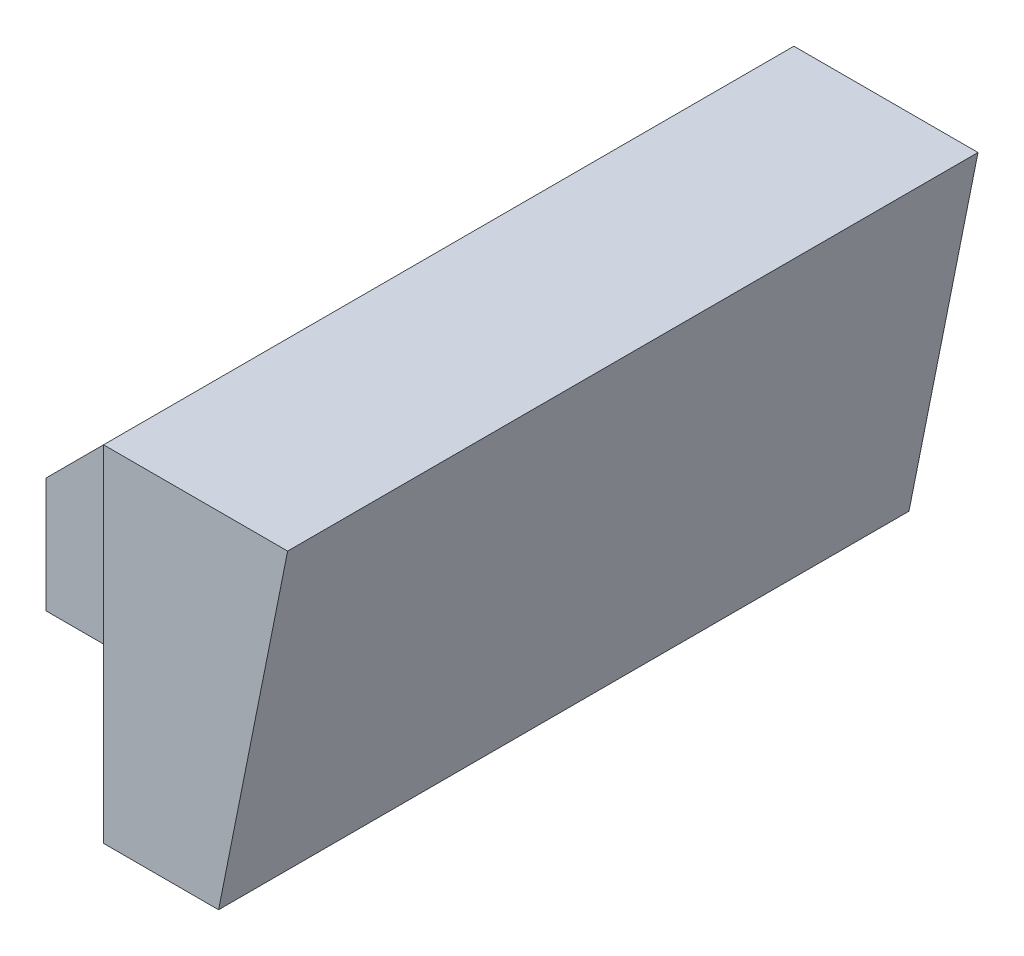
ISO-10303-21;
HEADER;
FILE_DESCRIPTION(('STEP AP214'),'2;1');
FILE_NAME('part.step','',(''),(''),'','','');
FILE_SCHEMA(('AUTOMOTIVE_DESIGN { 1 0 10303 214 1 1 1 1 }'));
ENDSEC;
DATA;
#1=APPLICATION_CONTEXT('core data for automotive mechanical design processes');
#2=APPLICATION_PROTOCOL_DEFINITION('international standard','automotive_design',2000,#1);
#3=PRODUCT_CONTEXT('',#1,'mechanical');
#4=PRODUCT('Part','Part','',(#3));
#5=PRODUCT_RELATED_PRODUCT_CATEGORY('part','',(#4));
#6=PRODUCT_DEFINITION_FORMATION('','',#4);
#7=PRODUCT_DEFINITION_CONTEXT('part definition',#1,'design');
#8=PRODUCT_DEFINITION('design','',#6,#7);
#9=PRODUCT_DEFINITION_SHAPE('','',#8);
#10=(LENGTH_UNIT() NAMED_UNIT(*) SI_UNIT(.MILLI.,.METRE.));
#11=(NAMED_UNIT(*) PLANE_ANGLE_UNIT() SI_UNIT($,.RADIAN.));
#12=(NAMED_UNIT(*) SI_UNIT($,.STERADIAN.) SOLID_ANGLE_UNIT());
#13=UNCERTAINTY_MEASURE_WITH_UNIT(LENGTH_MEASURE(1.E-05),#10,'distance_accuracy_value','');
#14=(GEOMETRIC_REPRESENTATION_CONTEXT(3) GLOBAL_UNCERTAINTY_ASSIGNED_CONTEXT((#13)) GLOBAL_UNIT_ASSIGNED_CONTEXT((#10,
#11,#12)) REPRESENTATION_CONTEXT('',''));
#15=CARTESIAN_POINT('',(0.,0.,0.));
#16=DIRECTION('',(0.,0.,1.));
#17=DIRECTION('',(1.,0.,0.));
#18=AXIS2_PLACEMENT_3D('',#15,#16,#17);
#19=CARTESIAN_POINT('',(0.,0.,0.));
#20=DIRECTION('',(0.,-1.,0.));
#21=DIRECTION('',(0.,0.,-1.));
#22=AXIS2_PLACEMENT_3D('',#19,#20,#21);
#23=PLANE('',#22);
#24=CARTESIAN_POINT('',(-9.,0.,0.));
#25=DIRECTION('',(0.,1.,0.));
#26=DIRECTION('',(0.,0.,1.));
#27=AXIS2_PLACEMENT_3D('',#24,#25,#26);
#28=CIRCLE('',#27,1.6);
#29=CARTESIAN_POINT('',(-7.42986451419408,0.,-0.307692307692306));
#30=VERTEX_POINT('',#29);
#31=CARTESIAN_POINT('',(-10.5701354858059,0.,-0.307692307692306));
#32=VERTEX_POINT('',#31);
#33=EDGE_CURVE('E243',#30,#32,#28,.T.);
#34=ORIENTED_EDGE('',*,*,#33,.T.);
#35=CARTESIAN_POINT('',(-11.5514701644346,0.,-0.499999999999999));
#36=DIRECTION('',(0.,-1.,0.));
#37=DIRECTION('',(0.,0.,-1.));
#38=AXIS2_PLACEMENT_3D('',#35,#36,#37);
#39=CIRCLE('',#38,1.);
#40=CARTESIAN_POINT('',(-11.5514701644346,0.,-1.5));
#41=VERTEX_POINT('',#40);
#42=EDGE_CURVE('E366',#32,#41,#39,.F.);
#43=ORIENTED_EDGE('',*,*,#42,.T.);
#44=DIRECTION('',(1.,0.,0.));
#45=VECTOR('',#44,1.);
#46=CARTESIAN_POINT('',(-14.,0.,-1.5));
#47=LINE('',#46,#45);
#48=CARTESIAN_POINT('',(-14.,0.,-1.5));
#49=VERTEX_POINT('',#48);
#50=EDGE_CURVE('E399',#49,#41,#47,.T.);
#51=ORIENTED_EDGE('',*,*,#50,.F.);
#52=DIRECTION('',(0.,0.,-1.));
#53=VECTOR('',#52,1.);
#54=CARTESIAN_POINT('',(-14.,0.,7.5));
#55=LINE('',#54,#53);
#56=CARTESIAN_POINT('',(-14.,0.,-7.5));
#57=VERTEX_POINT('',#56);
#58=EDGE_CURVE('E212',#49,#57,#55,.T.);
#59=ORIENTED_EDGE('',*,*,#58,.T.);
#60=DIRECTION('',(1.,0.,0.));
#61=VECTOR('',#60,1.);
#62=CARTESIAN_POINT('',(-14.,0.,-7.5));
#63=LINE('',#62,#61);
#64=CARTESIAN_POINT('',(-4.,0.,-7.5));
#65=VERTEX_POINT('',#64);
#66=EDGE_CURVE('E285',#57,#65,#63,.T.);
#67=ORIENTED_EDGE('',*,*,#66,.T.);
#68=DIRECTION('',(0.,0.,1.));
#69=VECTOR('',#68,1.);
#70=CARTESIAN_POINT('',(-4.,0.,15.));
#71=LINE('',#70,#69);
#72=CARTESIAN_POINT('',(-4.,0.,-15.));
#73=VERTEX_POINT('',#72);
#74=EDGE_CURVE('E325',#73,#65,#71,.T.);
#75=ORIENTED_EDGE('',*,*,#74,.F.);
#76=DIRECTION('',(-1.,0.,0.));
#77=VECTOR('',#76,1.);
#78=CARTESIAN_POINT('',(-4.,0.,-15.));
#79=LINE('',#78,#77);
#80=CARTESIAN_POINT('',(0.999999999999999,0.,-15.));
#81=VERTEX_POINT('',#80);
#82=EDGE_CURVE('E308',#81,#73,#79,.T.);
#83=ORIENTED_EDGE('',*,*,#82,.F.);
#84=DIRECTION('',(0.,0.,1.));
#85=VECTOR('',#84,1.);
#86=CARTESIAN_POINT('',(0.999999999999999,0.,-15.));
#87=LINE('',#86,#85);
#88=CARTESIAN_POINT('',(0.999999999999999,0.,15.));
#89=VERTEX_POINT('',#88);
#90=EDGE_CURVE('E304',#81,#89,#87,.T.);
#91=ORIENTED_EDGE('',*,*,#90,.T.);
#92=DIRECTION('',(1.,0.,0.));
#93=VECTOR('',#92,1.);
#94=CARTESIAN_POINT('',(-4.,0.,15.));
#95=LINE('',#94,#93);
#96=CARTESIAN_POINT('',(-4.,0.,15.));
#97=VERTEX_POINT('',#96);
#98=EDGE_CURVE('E313',#97,#89,#95,.T.);
#99=ORIENTED_EDGE('',*,*,#98,.F.);
#100=CARTESIAN_POINT('',(-4.,0.,7.5));
#101=VERTEX_POINT('',#100);
#102=EDGE_CURVE('E324',#101,#97,#71,.T.);
#103=ORIENTED_EDGE('',*,*,#102,.F.);
#104=DIRECTION('',(1.,0.,0.));
#105=VECTOR('',#104,1.);
#106=CARTESIAN_POINT('',(-14.,0.,7.5));
#107=LINE('',#106,#105);
#108=CARTESIAN_POINT('',(-14.,0.,7.5));
#109=VERTEX_POINT('',#108);
#110=EDGE_CURVE('E274',#109,#101,#107,.T.);
#111=ORIENTED_EDGE('',*,*,#110,.F.);
#112=CARTESIAN_POINT('',(-14.,0.,1.5));
#113=VERTEX_POINT('',#112);
#114=EDGE_CURVE('E293',#109,#113,#55,.T.);
#115=ORIENTED_EDGE('',*,*,#114,.T.);
#116=DIRECTION('',(-1.,0.,0.));
#117=VECTOR('',#116,1.);
#118=CARTESIAN_POINT('',(-14.,0.,1.5));
#119=LINE('',#118,#117);
#120=CARTESIAN_POINT('',(-11.5514701644346,0.,1.5));
#121=VERTEX_POINT('',#120);
#122=EDGE_CURVE('E207',#121,#113,#119,.T.);
#123=ORIENTED_EDGE('',*,*,#122,.F.);
#124=CARTESIAN_POINT('',(-11.5514701644346,0.,0.500000000000002));
#125=DIRECTION('',(0.,-1.,0.));
#126=DIRECTION('',(0.,0.,-1.));
#127=AXIS2_PLACEMENT_3D('',#124,#125,#126);
#128=CIRCLE('',#127,1.);
#129=CARTESIAN_POINT('',(-10.5701354858059,0.,0.307692307692309));
#130=VERTEX_POINT('',#129);
#131=EDGE_CURVE('E11',#121,#130,#128,.F.);
#132=ORIENTED_EDGE('',*,*,#131,.T.);
#133=CARTESIAN_POINT('',(-7.42986451419408,0.,0.307692307692309));
#134=VERTEX_POINT('',#133);
#135=EDGE_CURVE('E246',#130,#134,#28,.T.);
#136=ORIENTED_EDGE('',*,*,#135,.T.);
#137=CARTESIAN_POINT('',(-6.44852983556539,0.,0.500000000000002));
#138=DIRECTION('',(0.,-1.,0.));
#139=DIRECTION('',(0.,0.,-1.));
#140=AXIS2_PLACEMENT_3D('',#137,#138,#139);
#141=CIRCLE('',#140,1.);
#142=CARTESIAN_POINT('',(-6.44852983556539,0.,1.5));
#143=VERTEX_POINT('',#142);
#144=EDGE_CURVE('E41',#134,#143,#141,.F.);
#145=ORIENTED_EDGE('',*,*,#144,.T.);
#146=DIRECTION('',(-1.,0.,0.));
#147=VECTOR('',#146,1.);
#148=CARTESIAN_POINT('',(-8.443223563717,0.,1.5));
#149=LINE('',#148,#147);
#150=CARTESIAN_POINT('',(-4.,0.,1.5));
#151=VERTEX_POINT('',#150);
#152=EDGE_CURVE('E217',#151,#143,#149,.T.);
#153=ORIENTED_EDGE('',*,*,#152,.F.);
#154=DIRECTION('',(0.,0.,1.));
#155=VECTOR('',#154,1.);
#156=CARTESIAN_POINT('',(-4.,0.,-1.5));
#157=LINE('',#156,#155);
#158=CARTESIAN_POINT('',(-4.,0.,-1.5));
#159=VERTEX_POINT('',#158);
#160=EDGE_CURVE('E213',#159,#151,#157,.T.);
#161=ORIENTED_EDGE('',*,*,#160,.F.);
#162=DIRECTION('',(1.,0.,0.));
#163=VECTOR('',#162,1.);
#164=CARTESIAN_POINT('',(-8.443223563717,0.,-1.5));
#165=LINE('',#164,#163);
#166=CARTESIAN_POINT('',(-6.44852983556539,0.,-1.5));
#167=VERTEX_POINT('',#166);
#168=EDGE_CURVE('E226',#167,#159,#165,.T.);
#169=ORIENTED_EDGE('',*,*,#168,.F.);
#170=CARTESIAN_POINT('',(-6.44852983556539,0.,-0.499999999999999));
#171=DIRECTION('',(0.,-1.,0.));
#172=DIRECTION('',(0.,0.,-1.));
#173=AXIS2_PLACEMENT_3D('',#170,#171,#172);
#174=CIRCLE('',#173,1.);
#175=EDGE_CURVE('E368',#167,#30,#174,.F.);
#176=ORIENTED_EDGE('',*,*,#175,.T.);
#177=EDGE_LOOP('',(#34,#43,#51,#59,#67,#75,#83,#91,#99,#103,#111,#115,#123,#132,#136,#145,#153,
#161,#169,#176));
#178=FACE_BOUND('',#177,.T.);
#179=ADVANCED_FACE('F33',(#178),#23,.T.);
#180=CARTESIAN_POINT('',(-14.,5.,7.5));
#181=DIRECTION('',(0.707106781186547,-0.707106781186548,0.));
#182=DIRECTION('',(0.707106781186548,0.707106781186547,0.));
#183=AXIS2_PLACEMENT_3D('',#180,#181,#182);
#184=PLANE('',#183);
#185=DIRECTION('',(0.,0.,-1.));
#186=VECTOR('',#185,1.);
#187=CARTESIAN_POINT('',(-14.,5.,7.5));
#188=LINE('',#187,#186);
#189=CARTESIAN_POINT('',(-14.,5.,-4.5));
#190=VERTEX_POINT('',#189);
#191=CARTESIAN_POINT('',(-14.,5.,-7.5));
#192=VERTEX_POINT('',#191);
#193=EDGE_CURVE('E296',#190,#192,#188,.T.);
#194=ORIENTED_EDGE('',*,*,#193,.F.);
#195=DIRECTION('',(0.707106781186548,0.707106781186547,0.));
#196=VECTOR('',#195,1.);
#197=CARTESIAN_POINT('',(-14.,5.,-4.5));
#198=LINE('',#197,#196);
#199=CARTESIAN_POINT('',(-4.,15.,-4.5));
#200=VERTEX_POINT('',#199);
#201=EDGE_CURVE('E337',#190,#200,#198,.T.);
#202=ORIENTED_EDGE('',*,*,#201,.T.);
#203=DIRECTION('',(0.,0.,-1.));
#204=VECTOR('',#203,1.);
#205=CARTESIAN_POINT('',(-4.,15.,7.5));
#206=LINE('',#205,#204);
#207=CARTESIAN_POINT('',(-4.,15.,-7.5));
#208=VERTEX_POINT('',#207);
#209=EDGE_CURVE('E280',#200,#208,#206,.T.);
#210=ORIENTED_EDGE('',*,*,#209,.T.);
#211=DIRECTION('',(-0.707106781186548,-0.707106781186547,0.));
#212=VECTOR('',#211,1.);
#213=CARTESIAN_POINT('',(-14.,5.,-7.5));
#214=LINE('',#213,#212);
#215=EDGE_CURVE('E265',#208,#192,#214,.T.);
#216=ORIENTED_EDGE('',*,*,#215,.T.);
#217=EDGE_LOOP('',(#194,#202,#210,#216));
#218=FACE_BOUND('',#217,.T.);
#219=ADVANCED_FACE('F424',(#218),#184,.F.);
#220=CARTESIAN_POINT('',(-4.,15.,15.));
#221=DIRECTION('',(1.,0.,0.));
#222=DIRECTION('',(0.,0.,-1.));
#223=AXIS2_PLACEMENT_3D('',#220,#221,#222);
#224=PLANE('',#223);
#225=DIRECTION('',(0.,1.,0.));
#226=VECTOR('',#225,1.);
#227=CARTESIAN_POINT('',(-4.,0.,7.5));
#228=LINE('',#227,#226);
#229=CARTESIAN_POINT('',(-4.,15.,7.5));
#230=VERTEX_POINT('',#229);
#231=EDGE_CURVE('E277',#101,#230,#228,.T.);
#232=ORIENTED_EDGE('',*,*,#231,.F.);
#233=ORIENTED_EDGE('',*,*,#102,.T.);
#234=DIRECTION('',(0.,-1.,0.));
#235=VECTOR('',#234,1.);
#236=CARTESIAN_POINT('',(-4.,15.,15.));
#237=LINE('',#236,#235);
#238=CARTESIAN_POINT('',(-4.,15.,15.));
#239=VERTEX_POINT('',#238);
#240=EDGE_CURVE('E322',#239,#97,#237,.T.);
#241=ORIENTED_EDGE('',*,*,#240,.F.);
#242=DIRECTION('',(0.,0.,1.));
#243=VECTOR('',#242,1.);
#244=CARTESIAN_POINT('',(-4.,15.,15.));
#245=LINE('',#244,#243);
#246=EDGE_CURVE('E315',#230,#239,#245,.T.);
#247=ORIENTED_EDGE('',*,*,#246,.F.);
#248=EDGE_LOOP('',(#232,#233,#241,#247));
#249=FACE_BOUND('',#248,.T.);
#250=ADVANCED_FACE('F454',(#249),#224,.F.);
#251=CARTESIAN_POINT('',(-4.,15.,-15.));
#252=DIRECTION('',(0.,0.,1.));
#253=DIRECTION('',(1.,0.,0.));
#254=AXIS2_PLACEMENT_3D('',#251,#252,#253);
#255=PLANE('',#254);
#256=DIRECTION('',(-1.,0.,0.));
#257=VECTOR('',#256,1.);
#258=CARTESIAN_POINT('',(-4.,15.,-15.));
#259=LINE('',#258,#257);
#260=CARTESIAN_POINT('',(4.,15.,-15.));
#261=VERTEX_POINT('',#260);
#262=CARTESIAN_POINT('',(-4.,15.,-15.));
#263=VERTEX_POINT('',#262);
#264=EDGE_CURVE('E312',#261,#263,#259,.T.);
#265=ORIENTED_EDGE('',*,*,#264,.F.);
#266=DIRECTION('',(-0.196116135138184,-0.98058067569092,0.));
#267=VECTOR('',#266,1.);
#268=CARTESIAN_POINT('',(4.,15.,-15.));
#269=LINE('',#268,#267);
#270=EDGE_CURVE('E301',#261,#81,#269,.T.);
#271=ORIENTED_EDGE('',*,*,#270,.T.);
#272=ORIENTED_EDGE('',*,*,#82,.T.);
#273=DIRECTION('',(0.,-1.,0.));
#274=VECTOR('',#273,1.);
#275=CARTESIAN_POINT('',(-4.,15.,-15.));
#276=LINE('',#275,#274);
#277=EDGE_CURVE('E331',#263,#73,#276,.T.);
#278=ORIENTED_EDGE('',*,*,#277,.F.);
#279=EDGE_LOOP('',(#265,#271,#272,#278));
#280=FACE_BOUND('',#279,.T.);
#281=ADVANCED_FACE('F465',(#280),#255,.F.);
#282=ORIENTED_EDGE('',*,*,#74,.T.);
#283=DIRECTION('',(0.,1.,0.));
#284=VECTOR('',#283,1.);
#285=CARTESIAN_POINT('',(-4.,0.,-7.5));
#286=LINE('',#285,#284);
#287=EDGE_CURVE('E272',#65,#208,#286,.T.);
#288=ORIENTED_EDGE('',*,*,#287,.T.);
#289=EDGE_CURVE('E316',#263,#208,#245,.T.);
#290=ORIENTED_EDGE('',*,*,#289,.F.);
#291=ORIENTED_EDGE('',*,*,#277,.T.);
#292=EDGE_LOOP('',(#282,#288,#290,#291));
#293=FACE_BOUND('',#292,.T.);
#294=ADVANCED_FACE('F428',(#293),#224,.F.);
#295=CARTESIAN_POINT('',(-4.,15.,15.));
#296=DIRECTION('',(0.,0.,-1.));
#297=DIRECTION('',(-1.,0.,0.));
#298=AXIS2_PLACEMENT_3D('',#295,#296,#297);
#299=PLANE('',#298);
#300=ORIENTED_EDGE('',*,*,#98,.T.);
#301=DIRECTION('',(-0.196116135138184,-0.98058067569092,0.));
#302=VECTOR('',#301,1.);
#303=CARTESIAN_POINT('',(4.,15.,15.));
#304=LINE('',#303,#302);
#305=CARTESIAN_POINT('',(4.,15.,15.));
#306=VERTEX_POINT('',#305);
#307=EDGE_CURVE('E300',#306,#89,#304,.T.);
#308=ORIENTED_EDGE('',*,*,#307,.F.);
#309=DIRECTION('',(1.,0.,0.));
#310=VECTOR('',#309,1.);
#311=CARTESIAN_POINT('',(-4.,15.,15.));
#312=LINE('',#311,#310);
#313=EDGE_CURVE('E319',#239,#306,#312,.T.);
#314=ORIENTED_EDGE('',*,*,#313,.F.);
#315=ORIENTED_EDGE('',*,*,#240,.T.);
#316=EDGE_LOOP('',(#300,#308,#314,#315));
#317=FACE_BOUND('',#316,.T.);
#318=ADVANCED_FACE('F459',(#317),#299,.F.);
#319=CARTESIAN_POINT('',(0.,15.,0.));
#320=DIRECTION('',(0.,-1.,0.));
#321=DIRECTION('',(0.,0.,-1.));
#322=AXIS2_PLACEMENT_3D('',#319,#320,#321);
#323=PLANE('',#322);
#324=DIRECTION('',(0.,0.,-1.));
#325=VECTOR('',#324,1.);
#326=CARTESIAN_POINT('',(4.,15.,15.));
#327=LINE('',#326,#325);
#328=EDGE_CURVE('E309',#306,#261,#327,.T.);
#329=ORIENTED_EDGE('',*,*,#328,.T.);
#330=ORIENTED_EDGE('',*,*,#264,.T.);
#331=ORIENTED_EDGE('',*,*,#289,.T.);
#332=ORIENTED_EDGE('',*,*,#209,.F.);
#333=DIRECTION('',(0.,0.,-1.));
#334=VECTOR('',#333,1.);
#335=CARTESIAN_POINT('',(-4.,15.,-4.5));
#336=LINE('',#335,#334);
#337=CARTESIAN_POINT('',(-4.,15.,4.5));
#338=VERTEX_POINT('',#337);
#339=EDGE_CURVE('E245',#338,#200,#336,.T.);
#340=ORIENTED_EDGE('',*,*,#339,.F.);
#341=EDGE_CURVE('E290',#230,#338,#206,.T.);
#342=ORIENTED_EDGE('',*,*,#341,.F.);
#343=ORIENTED_EDGE('',*,*,#246,.T.);
#344=ORIENTED_EDGE('',*,*,#313,.T.);
#345=EDGE_LOOP('',(#329,#330,#331,#332,#340,#342,#343,#344));
#346=FACE_BOUND('',#345,.T.);
#347=ADVANCED_FACE('F418',(#346),#323,.F.);
#348=CARTESIAN_POINT('',(4.,15.,-15.));
#349=DIRECTION('',(-0.98058067569092,0.196116135138184,0.));
#350=DIRECTION('',(-0.196116135138184,-0.98058067569092,0.));
#351=AXIS2_PLACEMENT_3D('',#348,#349,#350);
#352=PLANE('',#351);
#353=ORIENTED_EDGE('',*,*,#307,.T.);
#354=ORIENTED_EDGE('',*,*,#90,.F.);
#355=ORIENTED_EDGE('',*,*,#270,.F.);
#356=ORIENTED_EDGE('',*,*,#328,.F.);
#357=EDGE_LOOP('',(#353,#354,#355,#356));
#358=FACE_BOUND('',#357,.T.);
#359=ADVANCED_FACE('F618',(#358),#352,.F.);
#360=ORIENTED_EDGE('',*,*,#341,.T.);
#361=DIRECTION('',(-0.707106781186548,-0.707106781186547,0.));
#362=VECTOR('',#361,1.);
#363=CARTESIAN_POINT('',(-14.,5.,4.5));
#364=LINE('',#363,#362);
#365=CARTESIAN_POINT('',(-14.,5.,4.5));
#366=VERTEX_POINT('',#365);
#367=EDGE_CURVE('E334',#338,#366,#364,.T.);
#368=ORIENTED_EDGE('',*,*,#367,.T.);
#369=CARTESIAN_POINT('',(-14.,5.,7.5));
#370=VERTEX_POINT('',#369);
#371=EDGE_CURVE('E297',#370,#366,#188,.T.);
#372=ORIENTED_EDGE('',*,*,#371,.F.);
#373=DIRECTION('',(-0.707106781186548,-0.707106781186547,0.));
#374=VECTOR('',#373,1.);
#375=CARTESIAN_POINT('',(-14.,5.,7.5));
#376=LINE('',#375,#374);
#377=EDGE_CURVE('E268',#230,#370,#376,.T.);
#378=ORIENTED_EDGE('',*,*,#377,.F.);
#379=EDGE_LOOP('',(#360,#368,#372,#378));
#380=FACE_BOUND('',#379,.T.);
#381=ADVANCED_FACE('F409',(#380),#184,.F.);
#382=CARTESIAN_POINT('',(-14.,0.,7.5));
#383=DIRECTION('',(1.,0.,0.));
#384=DIRECTION('',(0.,0.,-1.));
#385=AXIS2_PLACEMENT_3D('',#382,#383,#384);
#386=PLANE('',#385);
#387=DIRECTION('',(0.,-1.,0.));
#388=VECTOR('',#387,1.);
#389=CARTESIAN_POINT('',(-14.,0.,-7.5));
#390=LINE('',#389,#388);
#391=EDGE_CURVE('E283',#192,#57,#390,.T.);
#392=ORIENTED_EDGE('',*,*,#391,.T.);
#393=ORIENTED_EDGE('',*,*,#58,.F.);
#394=DIRECTION('',(0.,1.,0.));
#395=VECTOR('',#394,1.);
#396=CARTESIAN_POINT('',(-14.,-3.5,-1.5));
#397=LINE('',#396,#395);
#398=CARTESIAN_POINT('',(-14.,-3.5,-1.5));
#399=VERTEX_POINT('',#398);
#400=EDGE_CURVE('E192',#399,#49,#397,.T.);
#401=ORIENTED_EDGE('',*,*,#400,.F.);
#402=DIRECTION('',(0.,0.,-1.));
#403=VECTOR('',#402,1.);
#404=CARTESIAN_POINT('',(-14.,-3.5,-1.5));
#405=LINE('',#404,#403);
#406=CARTESIAN_POINT('',(-14.,-3.5,1.5));
#407=VERTEX_POINT('',#406);
#408=EDGE_CURVE('E198',#407,#399,#405,.T.);
#409=ORIENTED_EDGE('',*,*,#408,.F.);
#410=DIRECTION('',(0.,1.,0.));
#411=VECTOR('',#410,1.);
#412=CARTESIAN_POINT('',(-14.,-3.5,1.5));
#413=LINE('',#412,#411);
#414=EDGE_CURVE('E214',#407,#113,#413,.T.);
#415=ORIENTED_EDGE('',*,*,#414,.T.);
#416=ORIENTED_EDGE('',*,*,#114,.F.);
#417=DIRECTION('',(0.,-1.,0.));
#418=VECTOR('',#417,1.);
#419=CARTESIAN_POINT('',(-14.,0.,7.5));
#420=LINE('',#419,#418);
#421=EDGE_CURVE('E271',#370,#109,#420,.T.);
#422=ORIENTED_EDGE('',*,*,#421,.F.);
#423=ORIENTED_EDGE('',*,*,#371,.T.);
#424=DIRECTION('',(0.,0.,1.));
#425=VECTOR('',#424,1.);
#426=CARTESIAN_POINT('',(-14.,5.,-4.5));
#427=LINE('',#426,#425);
#428=EDGE_CURVE('E249',#190,#366,#427,.T.);
#429=ORIENTED_EDGE('',*,*,#428,.F.);
#430=ORIENTED_EDGE('',*,*,#193,.T.);
#431=EDGE_LOOP('',(#392,#393,#401,#409,#415,#416,#422,#423,#429,#430));
#432=FACE_BOUND('',#431,.T.);
#433=ADVANCED_FACE('F211',(#432),#386,.F.);
#434=CARTESIAN_POINT('',(0.,0.,7.5));
#435=DIRECTION('',(0.,0.,1.));
#436=DIRECTION('',(1.,0.,0.));
#437=AXIS2_PLACEMENT_3D('',#434,#435,#436);
#438=PLANE('',#437);
#439=ORIENTED_EDGE('',*,*,#377,.T.);
#440=ORIENTED_EDGE('',*,*,#421,.T.);
#441=ORIENTED_EDGE('',*,*,#110,.T.);
#442=ORIENTED_EDGE('',*,*,#231,.T.);
#443=EDGE_LOOP('',(#439,#440,#441,#442));
#444=FACE_BOUND('',#443,.T.);
#445=ADVANCED_FACE('F407',(#444),#438,.T.);
#446=CARTESIAN_POINT('',(0.,0.,-7.5));
#447=DIRECTION('',(0.,0.,1.));
#448=DIRECTION('',(1.,0.,0.));
#449=AXIS2_PLACEMENT_3D('',#446,#447,#448);
#450=PLANE('',#449);
#451=ORIENTED_EDGE('',*,*,#215,.F.);
#452=ORIENTED_EDGE('',*,*,#287,.F.);
#453=ORIENTED_EDGE('',*,*,#66,.F.);
#454=ORIENTED_EDGE('',*,*,#391,.F.);
#455=EDGE_LOOP('',(#451,#452,#453,#454));
#456=FACE_BOUND('',#455,.T.);
#457=ADVANCED_FACE('F432',(#456),#450,.F.);
#458=CARTESIAN_POINT('',(-14.,5.,-4.5));
#459=DIRECTION('',(0.,0.,-1.));
#460=DIRECTION('',(-1.,0.,0.));
#461=AXIS2_PLACEMENT_3D('',#458,#459,#460);
#462=PLANE('',#461);
#463=DIRECTION('',(-1.,0.,0.));
#464=VECTOR('',#463,1.);
#465=CARTESIAN_POINT('',(-14.,5.,-4.5));
#466=LINE('',#465,#464);
#467=CARTESIAN_POINT('',(-4.,5.,-4.5));
#468=VERTEX_POINT('',#467);
#469=EDGE_CURVE('E258',#468,#190,#466,.T.);
#470=ORIENTED_EDGE('',*,*,#469,.F.);
#471=DIRECTION('',(0.,1.,0.));
#472=VECTOR('',#471,1.);
#473=CARTESIAN_POINT('',(-4.,5.,-4.5));
#474=LINE('',#473,#472);
#475=EDGE_CURVE('E263',#468,#200,#474,.T.);
#476=ORIENTED_EDGE('',*,*,#475,.T.);
#477=ORIENTED_EDGE('',*,*,#201,.F.);
#478=EDGE_LOOP('',(#470,#476,#477));
#479=FACE_BOUND('',#478,.T.);
#480=ADVANCED_FACE('F438',(#479),#462,.F.);
#481=CARTESIAN_POINT('',(-14.,5.,4.5));
#482=DIRECTION('',(0.,0.,1.));
#483=DIRECTION('',(1.,0.,0.));
#484=AXIS2_PLACEMENT_3D('',#481,#482,#483);
#485=PLANE('',#484);
#486=DIRECTION('',(0.,1.,0.));
#487=VECTOR('',#486,1.);
#488=CARTESIAN_POINT('',(-4.,5.,4.5));
#489=LINE('',#488,#487);
#490=CARTESIAN_POINT('',(-4.,5.,4.5));
#491=VERTEX_POINT('',#490);
#492=EDGE_CURVE('E260',#491,#338,#489,.T.);
#493=ORIENTED_EDGE('',*,*,#492,.F.);
#494=DIRECTION('',(1.,0.,0.));
#495=VECTOR('',#494,1.);
#496=CARTESIAN_POINT('',(-14.,5.,4.5));
#497=LINE('',#496,#495);
#498=EDGE_CURVE('E252',#366,#491,#497,.T.);
#499=ORIENTED_EDGE('',*,*,#498,.F.);
#500=ORIENTED_EDGE('',*,*,#367,.F.);
#501=EDGE_LOOP('',(#493,#499,#500));
#502=FACE_BOUND('',#501,.T.);
#503=ADVANCED_FACE('F411',(#502),#485,.F.);
#504=CARTESIAN_POINT('',(-4.,5.,-4.5));
#505=DIRECTION('',(1.,0.,0.));
#506=DIRECTION('',(0.,0.,-1.));
#507=AXIS2_PLACEMENT_3D('',#504,#505,#506);
#508=PLANE('',#507);
#509=ORIENTED_EDGE('',*,*,#339,.T.);
#510=ORIENTED_EDGE('',*,*,#475,.F.);
#511=DIRECTION('',(0.,0.,-1.));
#512=VECTOR('',#511,1.);
#513=CARTESIAN_POINT('',(-4.,5.,-4.5));
#514=LINE('',#513,#512);
#515=EDGE_CURVE('E255',#491,#468,#514,.T.);
#516=ORIENTED_EDGE('',*,*,#515,.F.);
#517=ORIENTED_EDGE('',*,*,#492,.T.);
#518=EDGE_LOOP('',(#509,#510,#516,#517));
#519=FACE_BOUND('',#518,.T.);
#520=ADVANCED_FACE('F415',(#519),#508,.F.);
#521=CARTESIAN_POINT('',(0.,5.,0.));
#522=DIRECTION('',(0.,1.,0.));
#523=DIRECTION('',(0.,0.,1.));
#524=AXIS2_PLACEMENT_3D('',#521,#522,#523);
#525=PLANE('',#524);
#526=CARTESIAN_POINT('',(-9.,5.,0.));
#527=DIRECTION('',(0.,1.,0.));
#528=DIRECTION('',(0.,0.,1.));
#529=AXIS2_PLACEMENT_3D('',#526,#527,#528);
#530=CIRCLE('',#529,1.6);
#531=CARTESIAN_POINT('',(-9.,5.,1.6));
#532=VERTEX_POINT('',#531);
#533=EDGE_CURVE('E242',#532,#532,#530,.T.);
#534=ORIENTED_EDGE('',*,*,#533,.F.);
#535=EDGE_LOOP('',(#534));
#536=FACE_BOUND('',#535,.T.);
#537=ORIENTED_EDGE('',*,*,#428,.T.);
#538=ORIENTED_EDGE('',*,*,#498,.T.);
#539=ORIENTED_EDGE('',*,*,#515,.T.);
#540=ORIENTED_EDGE('',*,*,#469,.T.);
#541=EDGE_LOOP('',(#537,#538,#539,#540));
#542=FACE_BOUND('',#541,.T.);
#543=ADVANCED_FACE('F435',(#536,#542),#525,.T.);
#544=CARTESIAN_POINT('',(-9.,0.,0.));
#545=DIRECTION('',(0.,1.,0.));
#546=DIRECTION('',(0.,0.,1.));
#547=AXIS2_PLACEMENT_3D('',#544,#545,#546);
#548=CYLINDRICAL_SURFACE('',#547,1.6);
#549=CARTESIAN_POINT('',(-9.,-3.5,0.));
#550=DIRECTION('',(0.,1.,0.));
#551=DIRECTION('',(0.,0.,-1.));
#552=AXIS2_PLACEMENT_3D('',#549,#550,#551);
#553=CIRCLE('',#552,1.6);
#554=CARTESIAN_POINT('',(-10.5701354858059,-3.5,-0.307692307692306));
#555=VERTEX_POINT('',#554);
#556=CARTESIAN_POINT('',(-10.5701354858059,-3.5,0.307692307692309));
#557=VERTEX_POINT('',#556);
#558=EDGE_CURVE('E197',#555,#557,#553,.T.);
#559=ORIENTED_EDGE('',*,*,#558,.F.);
#560=DIRECTION('',(0.,1.,0.));
#561=VECTOR('',#560,1.);
#562=CARTESIAN_POINT('',(-10.5701354858059,0.,-0.307692307692306));
#563=LINE('',#562,#561);
#564=EDGE_CURVE('E347',#555,#32,#563,.T.);
#565=ORIENTED_EDGE('',*,*,#564,.T.);
#566=ORIENTED_EDGE('',*,*,#33,.F.);
#567=DIRECTION('',(0.,1.,0.));
#568=VECTOR('',#567,1.);
#569=CARTESIAN_POINT('',(-7.42986451419408,0.,-0.307692307692306));
#570=LINE('',#569,#568);
#571=CARTESIAN_POINT('',(-7.42986451419408,-3.5,-0.307692307692306));
#572=VERTEX_POINT('',#571);
#573=EDGE_CURVE('E345',#30,#572,#570,.F.);
#574=ORIENTED_EDGE('',*,*,#573,.T.);
#575=CARTESIAN_POINT('',(-9.,-3.5,0.));
#576=DIRECTION('',(0.,1.,0.));
#577=DIRECTION('',(0.,0.,-1.));
#578=AXIS2_PLACEMENT_3D('',#575,#576,#577);
#579=CIRCLE('',#578,1.6);
#580=CARTESIAN_POINT('',(-7.42986451419408,-3.5,0.307692307692309));
#581=VERTEX_POINT('',#580);
#582=EDGE_CURVE('E229',#581,#572,#579,.T.);
#583=ORIENTED_EDGE('',*,*,#582,.F.);
#584=DIRECTION('',(0.,1.,0.));
#585=VECTOR('',#584,1.);
#586=CARTESIAN_POINT('',(-7.42986451419408,0.,0.307692307692309));
#587=LINE('',#586,#585);
#588=EDGE_CURVE('E342',#581,#134,#587,.T.);
#589=ORIENTED_EDGE('',*,*,#588,.T.);
#590=ORIENTED_EDGE('',*,*,#135,.F.);
#591=DIRECTION('',(0.,1.,0.));
#592=VECTOR('',#591,1.);
#593=CARTESIAN_POINT('',(-10.5701354858059,0.,0.307692307692309));
#594=LINE('',#593,#592);
#595=EDGE_CURVE('E340',#130,#557,#594,.F.);
#596=ORIENTED_EDGE('',*,*,#595,.T.);
#597=EDGE_LOOP('',(#559,#565,#566,#574,#583,#589,#590,#596));
#598=FACE_BOUND('',#597,.T.);
#599=ORIENTED_EDGE('',*,*,#533,.T.);
#600=EDGE_LOOP('',(#599));
#601=FACE_BOUND('',#600,.T.);
#602=ADVANCED_FACE('F381',(#598,#601),#548,.F.);
#603=CARTESIAN_POINT('',(-4.,-3.5,-1.5));
#604=DIRECTION('',(-1.,0.,0.));
#605=DIRECTION('',(0.,0.,1.));
#606=AXIS2_PLACEMENT_3D('',#603,#604,#605);
#607=PLANE('',#606);
#608=ORIENTED_EDGE('',*,*,#160,.T.);
#609=DIRECTION('',(0.,1.,0.));
#610=VECTOR('',#609,1.);
#611=CARTESIAN_POINT('',(-4.,-3.5,1.5));
#612=LINE('',#611,#610);
#613=CARTESIAN_POINT('',(-4.,-3.5,1.5));
#614=VERTEX_POINT('',#613);
#615=EDGE_CURVE('E239',#614,#151,#612,.T.);
#616=ORIENTED_EDGE('',*,*,#615,.F.);
#617=DIRECTION('',(0.,0.,1.));
#618=VECTOR('',#617,1.);
#619=CARTESIAN_POINT('',(-4.,-3.5,-1.5));
#620=LINE('',#619,#618);
#621=CARTESIAN_POINT('',(-4.,-3.5,-1.5));
#622=VERTEX_POINT('',#621);
#623=EDGE_CURVE('E222',#622,#614,#620,.T.);
#624=ORIENTED_EDGE('',*,*,#623,.F.);
#625=DIRECTION('',(0.,1.,0.));
#626=VECTOR('',#625,1.);
#627=CARTESIAN_POINT('',(-4.,-3.5,-1.5));
#628=LINE('',#627,#626);
#629=EDGE_CURVE('E233',#622,#159,#628,.T.);
#630=ORIENTED_EDGE('',*,*,#629,.T.);
#631=EDGE_LOOP('',(#608,#616,#624,#630));
#632=FACE_BOUND('',#631,.T.);
#633=ADVANCED_FACE('F548',(#632),#607,.F.);
#634=CARTESIAN_POINT('',(-8.443223563717,-3.5,1.5));
#635=DIRECTION('',(0.,0.,-1.));
#636=DIRECTION('',(-1.,0.,0.));
#637=AXIS2_PLACEMENT_3D('',#634,#635,#636);
#638=PLANE('',#637);
#639=ORIENTED_EDGE('',*,*,#152,.T.);
#640=DIRECTION('',(0.,1.,0.));
#641=VECTOR('',#640,1.);
#642=CARTESIAN_POINT('',(-6.44852983556539,-3.5,1.5));
#643=LINE('',#642,#641);
#644=CARTESIAN_POINT('',(-6.44852983556539,-3.5,1.5));
#645=VERTEX_POINT('',#644);
#646=EDGE_CURVE('E362',#143,#645,#643,.F.);
#647=ORIENTED_EDGE('',*,*,#646,.T.);
#648=DIRECTION('',(-1.,0.,0.));
#649=VECTOR('',#648,1.);
#650=CARTESIAN_POINT('',(-8.443223563717,-3.5,1.5));
#651=LINE('',#650,#649);
#652=EDGE_CURVE('E225',#614,#645,#651,.T.);
#653=ORIENTED_EDGE('',*,*,#652,.F.);
#654=ORIENTED_EDGE('',*,*,#615,.T.);
#655=EDGE_LOOP('',(#639,#647,#653,#654));
#656=FACE_BOUND('',#655,.T.);
#657=ADVANCED_FACE('F538',(#656),#638,.F.);
#658=CARTESIAN_POINT('',(-8.443223563717,-3.5,-1.5));
#659=DIRECTION('',(0.,0.,1.));
#660=DIRECTION('',(1.,0.,0.));
#661=AXIS2_PLACEMENT_3D('',#658,#659,#660);
#662=PLANE('',#661);
#663=DIRECTION('',(1.,0.,0.));
#664=VECTOR('',#663,1.);
#665=CARTESIAN_POINT('',(-8.443223563717,-3.5,-1.5));
#666=LINE('',#665,#664);
#667=CARTESIAN_POINT('',(-6.44852983556539,-3.5,-1.5));
#668=VERTEX_POINT('',#667);
#669=EDGE_CURVE('E232',#668,#622,#666,.T.);
#670=ORIENTED_EDGE('',*,*,#669,.F.);
#671=DIRECTION('',(0.,1.,0.));
#672=VECTOR('',#671,1.);
#673=CARTESIAN_POINT('',(-6.44852983556539,-3.5,-1.5));
#674=LINE('',#673,#672);
#675=EDGE_CURVE('E355',#668,#167,#674,.T.);
#676=ORIENTED_EDGE('',*,*,#675,.T.);
#677=ORIENTED_EDGE('',*,*,#168,.T.);
#678=ORIENTED_EDGE('',*,*,#629,.F.);
#679=EDGE_LOOP('',(#670,#676,#677,#678));
#680=FACE_BOUND('',#679,.T.);
#681=ADVANCED_FACE('F529',(#680),#662,.F.);
#682=CARTESIAN_POINT('',(-9.,-3.5,0.));
#683=DIRECTION('',(0.,-1.,0.));
#684=DIRECTION('',(0.,0.,-1.));
#685=AXIS2_PLACEMENT_3D('',#682,#683,#684);
#686=PLANE('',#685);
#687=ORIENTED_EDGE('',*,*,#582,.T.);
#688=CARTESIAN_POINT('',(-6.44852983556539,-3.5,-0.499999999999999));
#689=DIRECTION('',(0.,-1.,0.));
#690=DIRECTION('',(0.,0.,-1.));
#691=AXIS2_PLACEMENT_3D('',#688,#689,#690);
#692=CIRCLE('',#691,1.);
#693=EDGE_CURVE('E360',#572,#668,#692,.T.);
#694=ORIENTED_EDGE('',*,*,#693,.T.);
#695=ORIENTED_EDGE('',*,*,#669,.T.);
#696=ORIENTED_EDGE('',*,*,#623,.T.);
#697=ORIENTED_EDGE('',*,*,#652,.T.);
#698=CARTESIAN_POINT('',(-6.44852983556539,-3.5,0.500000000000002));
#699=DIRECTION('',(0.,-1.,0.));
#700=DIRECTION('',(0.,0.,-1.));
#701=AXIS2_PLACEMENT_3D('',#698,#699,#700);
#702=CIRCLE('',#701,1.);
#703=EDGE_CURVE('E358',#645,#581,#702,.T.);
#704=ORIENTED_EDGE('',*,*,#703,.T.);
#705=EDGE_LOOP('',(#687,#694,#695,#696,#697,#704));
#706=FACE_BOUND('',#705,.T.);
#707=ADVANCED_FACE('F385',(#706),#686,.T.);
#708=CARTESIAN_POINT('',(-14.,-3.5,-1.5));
#709=DIRECTION('',(0.,0.,1.));
#710=DIRECTION('',(1.,0.,0.));
#711=AXIS2_PLACEMENT_3D('',#708,#709,#710);
#712=PLANE('',#711);
#713=ORIENTED_EDGE('',*,*,#50,.T.);
#714=DIRECTION('',(0.,1.,0.));
#715=VECTOR('',#714,1.);
#716=CARTESIAN_POINT('',(-11.5514701644346,-3.5,-1.5));
#717=LINE('',#716,#715);
#718=CARTESIAN_POINT('',(-11.5514701644346,-3.5,-1.5));
#719=VERTEX_POINT('',#718);
#720=EDGE_CURVE('E194',#41,#719,#717,.F.);
#721=ORIENTED_EDGE('',*,*,#720,.T.);
#722=DIRECTION('',(1.,0.,0.));
#723=VECTOR('',#722,1.);
#724=CARTESIAN_POINT('',(-14.,-3.5,-1.5));
#725=LINE('',#724,#723);
#726=EDGE_CURVE('E187',#399,#719,#725,.T.);
#727=ORIENTED_EDGE('',*,*,#726,.F.);
#728=ORIENTED_EDGE('',*,*,#400,.T.);
#729=EDGE_LOOP('',(#713,#721,#727,#728));
#730=FACE_BOUND('',#729,.T.);
#731=ADVANCED_FACE('F190',(#730),#712,.F.);
#732=CARTESIAN_POINT('',(-14.,-3.5,1.5));
#733=DIRECTION('',(0.,0.,-1.));
#734=DIRECTION('',(-1.,0.,0.));
#735=AXIS2_PLACEMENT_3D('',#732,#733,#734);
#736=PLANE('',#735);
#737=DIRECTION('',(-1.,0.,0.));
#738=VECTOR('',#737,1.);
#739=CARTESIAN_POINT('',(-14.,-3.5,1.5));
#740=LINE('',#739,#738);
#741=CARTESIAN_POINT('',(-11.5514701644346,-3.5,1.5));
#742=VERTEX_POINT('',#741);
#743=EDGE_CURVE('E203',#742,#407,#740,.T.);
#744=ORIENTED_EDGE('',*,*,#743,.F.);
#745=DIRECTION('',(0.,1.,0.));
#746=VECTOR('',#745,1.);
#747=CARTESIAN_POINT('',(-11.5514701644346,-3.5,1.5));
#748=LINE('',#747,#746);
#749=EDGE_CURVE('E364',#742,#121,#748,.T.);
#750=ORIENTED_EDGE('',*,*,#749,.T.);
#751=ORIENTED_EDGE('',*,*,#122,.T.);
#752=ORIENTED_EDGE('',*,*,#414,.F.);
#753=EDGE_LOOP('',(#744,#750,#751,#752));
#754=FACE_BOUND('',#753,.T.);
#755=ADVANCED_FACE('F395',(#754),#736,.F.);
#756=CARTESIAN_POINT('',(-9.,-3.5,0.));
#757=DIRECTION('',(0.,-1.,0.));
#758=DIRECTION('',(0.,0.,-1.));
#759=AXIS2_PLACEMENT_3D('',#756,#757,#758);
#760=PLANE('',#759);
#761=ORIENTED_EDGE('',*,*,#726,.T.);
#762=CARTESIAN_POINT('',(-11.5514701644346,-3.5,-0.499999999999999));
#763=DIRECTION('',(0.,-1.,0.));
#764=DIRECTION('',(0.,0.,-1.));
#765=AXIS2_PLACEMENT_3D('',#762,#763,#764);
#766=CIRCLE('',#765,1.);
#767=EDGE_CURVE('E353',#719,#555,#766,.T.);
#768=ORIENTED_EDGE('',*,*,#767,.T.);
#769=ORIENTED_EDGE('',*,*,#558,.T.);
#770=CARTESIAN_POINT('',(-11.5514701644346,-3.5,0.500000000000002));
#771=DIRECTION('',(0.,-1.,0.));
#772=DIRECTION('',(0.,0.,-1.));
#773=AXIS2_PLACEMENT_3D('',#770,#771,#772);
#774=CIRCLE('',#773,1.);
#775=EDGE_CURVE('E351',#557,#742,#774,.T.);
#776=ORIENTED_EDGE('',*,*,#775,.T.);
#777=ORIENTED_EDGE('',*,*,#743,.T.);
#778=ORIENTED_EDGE('',*,*,#408,.T.);
#779=EDGE_LOOP('',(#761,#768,#769,#776,#777,#778));
#780=FACE_BOUND('',#779,.T.);
#781=ADVANCED_FACE('F201',(#780),#760,.T.);
#782=CARTESIAN_POINT('',(-11.5514701644346,0.,-0.499999999999999));
#783=DIRECTION('',(0.,1.,0.));
#784=DIRECTION('',(0.,0.,1.));
#785=AXIS2_PLACEMENT_3D('',#782,#783,#784);
#786=CYLINDRICAL_SURFACE('',#785,1.);
#787=ORIENTED_EDGE('',*,*,#767,.F.);
#788=ORIENTED_EDGE('',*,*,#720,.F.);
#789=ORIENTED_EDGE('',*,*,#42,.F.);
#790=ORIENTED_EDGE('',*,*,#564,.F.);
#791=EDGE_LOOP('',(#787,#788,#789,#790));
#792=FACE_BOUND('',#791,.T.);
#793=ADVANCED_FACE('F469',(#792),#786,.T.);
#794=CARTESIAN_POINT('',(-6.44852983556539,0.,-0.499999999999999));
#795=DIRECTION('',(0.,1.,0.));
#796=DIRECTION('',(0.,0.,1.));
#797=AXIS2_PLACEMENT_3D('',#794,#795,#796);
#798=CYLINDRICAL_SURFACE('',#797,1.);
#799=ORIENTED_EDGE('',*,*,#693,.F.);
#800=ORIENTED_EDGE('',*,*,#573,.F.);
#801=ORIENTED_EDGE('',*,*,#175,.F.);
#802=ORIENTED_EDGE('',*,*,#675,.F.);
#803=EDGE_LOOP('',(#799,#800,#801,#802));
#804=FACE_BOUND('',#803,.T.);
#805=ADVANCED_FACE('F377',(#804),#798,.T.);
#806=CARTESIAN_POINT('',(-6.44852983556539,0.,0.500000000000002));
#807=DIRECTION('',(0.,1.,0.));
#808=DIRECTION('',(0.,0.,1.));
#809=AXIS2_PLACEMENT_3D('',#806,#807,#808);
#810=CYLINDRICAL_SURFACE('',#809,1.);
#811=ORIENTED_EDGE('',*,*,#703,.F.);
#812=ORIENTED_EDGE('',*,*,#646,.F.);
#813=ORIENTED_EDGE('',*,*,#144,.F.);
#814=ORIENTED_EDGE('',*,*,#588,.F.);
#815=EDGE_LOOP('',(#811,#812,#813,#814));
#816=FACE_BOUND('',#815,.T.);
#817=ADVANCED_FACE('F390',(#816),#810,.T.);
#818=CARTESIAN_POINT('',(-11.5514701644346,0.,0.500000000000002));
#819=DIRECTION('',(0.,1.,0.));
#820=DIRECTION('',(0.,0.,1.));
#821=AXIS2_PLACEMENT_3D('',#818,#819,#820);
#822=CYLINDRICAL_SURFACE('',#821,1.);
#823=ORIENTED_EDGE('',*,*,#775,.F.);
#824=ORIENTED_EDGE('',*,*,#595,.F.);
#825=ORIENTED_EDGE('',*,*,#131,.F.);
#826=ORIENTED_EDGE('',*,*,#749,.F.);
#827=EDGE_LOOP('',(#823,#824,#825,#826));
#828=FACE_BOUND('',#827,.T.);
#829=ADVANCED_FACE('F35',(#828),#822,.T.);
#830=CLOSED_SHELL('',(#179,#219,#250,#281,#294,#318,#347,#359,#381,#433,#445,#457,#480,#503,
#520,#543,#602,#633,#657,#681,#707,#731,#755,#781,#793,#805,#817,#829));
#831=MANIFOLD_SOLID_BREP('B2',#830);
#832=ADVANCED_BREP_SHAPE_REPRESENTATION('',(#18,#831),#14);
#833=SHAPE_DEFINITION_REPRESENTATION(#9,#832);
ENDSEC;
END-ISO-10303-21;
